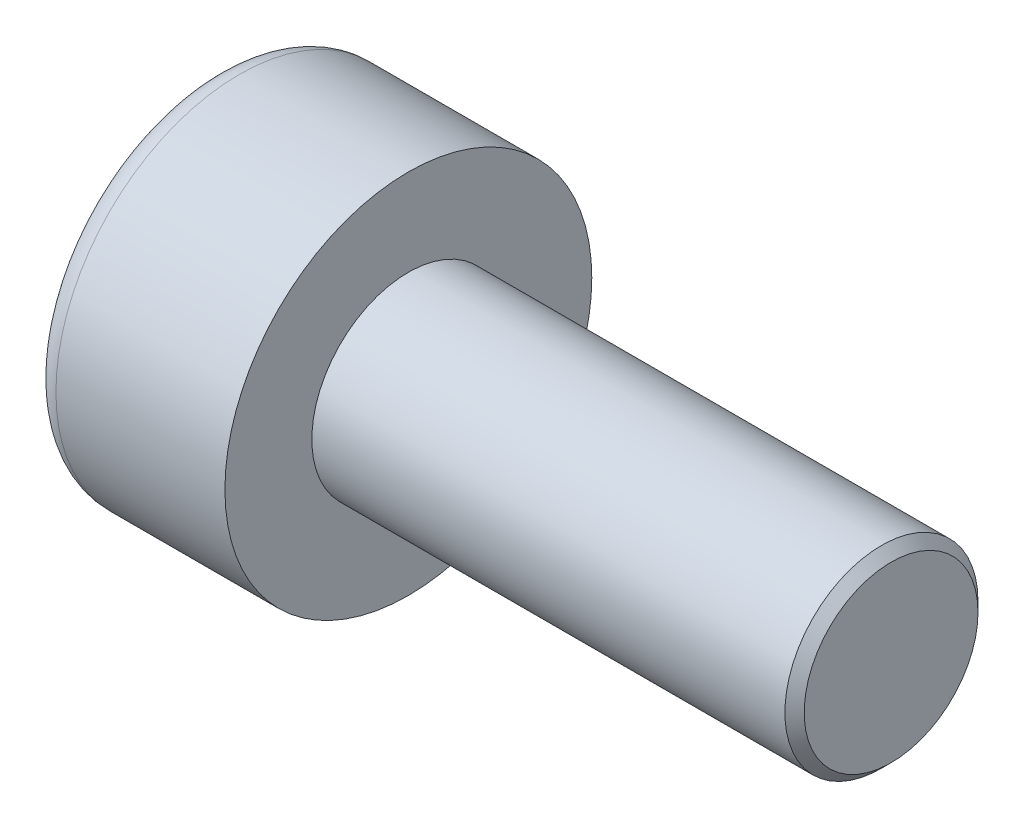
ISO-10303-21;
HEADER;
FILE_DESCRIPTION(('STEP AP214'),'2;1');
FILE_NAME('part.step','',(''),(''),'','','');
FILE_SCHEMA(('AUTOMOTIVE_DESIGN { 1 0 10303 214 1 1 1 1 }'));
ENDSEC;
DATA;
#1=APPLICATION_CONTEXT('core data for automotive mechanical design processes');
#2=APPLICATION_PROTOCOL_DEFINITION('international standard','automotive_design',2000,#1);
#3=PRODUCT_CONTEXT('',#1,'mechanical');
#4=PRODUCT('Part','Part','',(#3));
#5=PRODUCT_RELATED_PRODUCT_CATEGORY('part','',(#4));
#6=PRODUCT_DEFINITION_FORMATION('','',#4);
#7=PRODUCT_DEFINITION_CONTEXT('part definition',#1,'design');
#8=PRODUCT_DEFINITION('design','',#6,#7);
#9=PRODUCT_DEFINITION_SHAPE('','',#8);
#10=(LENGTH_UNIT() NAMED_UNIT(*) SI_UNIT(.MILLI.,.METRE.));
#11=(NAMED_UNIT(*) PLANE_ANGLE_UNIT() SI_UNIT($,.RADIAN.));
#12=(NAMED_UNIT(*) SI_UNIT($,.STERADIAN.) SOLID_ANGLE_UNIT());
#13=UNCERTAINTY_MEASURE_WITH_UNIT(LENGTH_MEASURE(1.E-05),#10,'distance_accuracy_value','');
#14=(GEOMETRIC_REPRESENTATION_CONTEXT(3) GLOBAL_UNCERTAINTY_ASSIGNED_CONTEXT((#13)) GLOBAL_UNIT_ASSIGNED_CONTEXT((#10,
#11,#12)) REPRESENTATION_CONTEXT('',''));
#15=CARTESIAN_POINT('',(0.,0.,0.));
#16=DIRECTION('',(0.,0.,1.));
#17=DIRECTION('',(1.,0.,0.));
#18=AXIS2_PLACEMENT_3D('',#15,#16,#17);
#19=CARTESIAN_POINT('',(1.,-1.5,0.));
#20=DIRECTION('',(-1.,0.,0.));
#21=DIRECTION('',(0.,0.,1.));
#22=AXIS2_PLACEMENT_3D('',#19,#20,#21);
#23=PLANE('',#22);
#24=DIRECTION('',(0.,-0.866025403784438,-0.500000000000001));
#25=VECTOR('',#24,1.);
#26=CARTESIAN_POINT('',(1.,0.,0.866025403784438));
#27=LINE('',#26,#25);
#28=CARTESIAN_POINT('',(1.,-0.375,0.649519052838328));
#29=VERTEX_POINT('',#28);
#30=CARTESIAN_POINT('',(1.,-0.749999999999999,0.433012701892218));
#31=VERTEX_POINT('',#30);
#32=EDGE_CURVE('E161',#29,#31,#27,.T.);
#33=ORIENTED_EDGE('',*,*,#32,.F.);
#34=CARTESIAN_POINT('',(1.,0.,0.));
#35=DIRECTION('',(-1.,0.,0.));
#36=DIRECTION('',(0.,0.,1.));
#37=AXIS2_PLACEMENT_3D('',#34,#35,#36);
#38=CIRCLE('',#37,0.749999999999999);
#39=CARTESIAN_POINT('',(1.,-0.749999999999999,0.));
#40=VERTEX_POINT('',#39);
#41=EDGE_CURVE('E56',#29,#40,#38,.F.);
#42=ORIENTED_EDGE('',*,*,#41,.T.);
#43=DIRECTION('',(0.,0.,-1.));
#44=VECTOR('',#43,1.);
#45=CARTESIAN_POINT('',(1.,-0.749999999999999,0.433012701892218));
#46=LINE('',#45,#44);
#47=EDGE_CURVE('E166',#31,#40,#46,.T.);
#48=ORIENTED_EDGE('',*,*,#47,.F.);
#49=EDGE_LOOP('',(#33,#42,#48));
#50=FACE_BOUND('',#49,.T.);
#51=ADVANCED_FACE('F41',(#50),#23,.T.);
#52=CARTESIAN_POINT('',(1.,-0.749999999999999,-0.433012701892221));
#53=VERTEX_POINT('',#52);
#54=EDGE_CURVE('E165',#40,#53,#46,.T.);
#55=ORIENTED_EDGE('',*,*,#54,.F.);
#56=CARTESIAN_POINT('',(1.,-0.375,-0.649519052838329));
#57=VERTEX_POINT('',#56);
#58=EDGE_CURVE('E141',#40,#57,#38,.F.);
#59=ORIENTED_EDGE('',*,*,#58,.T.);
#60=DIRECTION('',(0.,0.866025403784439,-0.5));
#61=VECTOR('',#60,1.);
#62=CARTESIAN_POINT('',(1.,-0.749999999999999,-0.433012701892221));
#63=LINE('',#62,#61);
#64=EDGE_CURVE('E149',#53,#57,#63,.T.);
#65=ORIENTED_EDGE('',*,*,#64,.F.);
#66=EDGE_LOOP('',(#55,#59,#65));
#67=FACE_BOUND('',#66,.T.);
#68=ADVANCED_FACE('F222',(#67),#23,.T.);
#69=CARTESIAN_POINT('',(1.,0.,-0.86602540378444));
#70=VERTEX_POINT('',#69);
#71=EDGE_CURVE('E139',#57,#70,#63,.T.);
#72=ORIENTED_EDGE('',*,*,#71,.F.);
#73=CARTESIAN_POINT('',(1.,0.375,-0.649519052838328));
#74=VERTEX_POINT('',#73);
#75=EDGE_CURVE('E123',#57,#74,#38,.F.);
#76=ORIENTED_EDGE('',*,*,#75,.T.);
#77=DIRECTION('',(0.,0.866025403784438,0.5));
#78=VECTOR('',#77,1.);
#79=CARTESIAN_POINT('',(1.,0.,-0.86602540378444));
#80=LINE('',#79,#78);
#81=EDGE_CURVE('E137',#70,#74,#80,.T.);
#82=ORIENTED_EDGE('',*,*,#81,.F.);
#83=EDGE_LOOP('',(#72,#76,#82));
#84=FACE_BOUND('',#83,.T.);
#85=ADVANCED_FACE('F135',(#84),#23,.T.);
#86=CARTESIAN_POINT('',(1.,0.75,-0.43301270189222));
#87=VERTEX_POINT('',#86);
#88=EDGE_CURVE('E143',#74,#87,#80,.T.);
#89=ORIENTED_EDGE('',*,*,#88,.F.);
#90=CARTESIAN_POINT('',(1.,0.,0.));
#91=DIRECTION('',(1.,0.,0.));
#92=DIRECTION('',(0.,0.,-1.));
#93=AXIS2_PLACEMENT_3D('',#90,#91,#92);
#94=CIRCLE('',#93,0.749999999999999);
#95=CARTESIAN_POINT('',(1.,0.749999999999999,0.));
#96=VERTEX_POINT('',#95);
#97=EDGE_CURVE('E121',#74,#96,#94,.T.);
#98=ORIENTED_EDGE('',*,*,#97,.T.);
#99=DIRECTION('',(0.,0.,1.));
#100=VECTOR('',#99,1.);
#101=CARTESIAN_POINT('',(1.,0.75,-0.43301270189222));
#102=LINE('',#101,#100);
#103=EDGE_CURVE('E146',#87,#96,#102,.T.);
#104=ORIENTED_EDGE('',*,*,#103,.F.);
#105=EDGE_LOOP('',(#89,#98,#104));
#106=FACE_BOUND('',#105,.T.);
#107=ADVANCED_FACE('F144',(#106),#23,.T.);
#108=CARTESIAN_POINT('',(1.,0.75,0.433012701892218));
#109=VERTEX_POINT('',#108);
#110=EDGE_CURVE('E153',#96,#109,#102,.T.);
#111=ORIENTED_EDGE('',*,*,#110,.F.);
#112=CARTESIAN_POINT('',(1.,0.375,0.649519052838328));
#113=VERTEX_POINT('',#112);
#114=EDGE_CURVE('E126',#96,#113,#38,.F.);
#115=ORIENTED_EDGE('',*,*,#114,.T.);
#116=DIRECTION('',(0.,-0.866025403784438,0.5));
#117=VECTOR('',#116,1.);
#118=CARTESIAN_POINT('',(1.,0.75,0.433012701892218));
#119=LINE('',#118,#117);
#120=EDGE_CURVE('E158',#109,#113,#119,.T.);
#121=ORIENTED_EDGE('',*,*,#120,.F.);
#122=EDGE_LOOP('',(#111,#115,#121));
#123=FACE_BOUND('',#122,.T.);
#124=ADVANCED_FACE('F234',(#123),#23,.T.);
#125=CARTESIAN_POINT('',(1.,0.,0.866025403784438));
#126=VERTEX_POINT('',#125);
#127=EDGE_CURVE('E157',#113,#126,#119,.T.);
#128=ORIENTED_EDGE('',*,*,#127,.F.);
#129=EDGE_CURVE('E202',#113,#29,#38,.F.);
#130=ORIENTED_EDGE('',*,*,#129,.T.);
#131=EDGE_CURVE('E162',#126,#29,#27,.T.);
#132=ORIENTED_EDGE('',*,*,#131,.F.);
#133=EDGE_LOOP('',(#128,#130,#132));
#134=FACE_BOUND('',#133,.T.);
#135=ADVANCED_FACE('F225',(#134),#23,.T.);
#136=CARTESIAN_POINT('',(0.,0.,0.));
#137=DIRECTION('',(1.,0.,0.));
#138=DIRECTION('',(0.,0.,-1.));
#139=AXIS2_PLACEMENT_3D('',#136,#137,#138);
#140=PLANE('',#139);
#141=CARTESIAN_POINT('',(0.,0.,0.));
#142=DIRECTION('',(1.,0.,0.));
#143=DIRECTION('',(0.,0.,-1.));
#144=AXIS2_PLACEMENT_3D('',#141,#142,#143);
#145=CIRCLE('',#144,1.65);
#146=CARTESIAN_POINT('',(0.,0.,-1.65));
#147=VERTEX_POINT('',#146);
#148=EDGE_CURVE('E207',#147,#147,#145,.F.);
#149=ORIENTED_EDGE('',*,*,#148,.T.);
#150=EDGE_LOOP('',(#149));
#151=FACE_BOUND('',#150,.T.);
#152=DIRECTION('',(0.,0.866025403784439,-0.5));
#153=VECTOR('',#152,1.);
#154=CARTESIAN_POINT('',(0.,-0.749999999999999,-0.433012701892221));
#155=LINE('',#154,#153);
#156=CARTESIAN_POINT('',(0.,-0.749999999999999,-0.433012701892221));
#157=VERTEX_POINT('',#156);
#158=CARTESIAN_POINT('',(0.,0.,-0.86602540378444));
#159=VERTEX_POINT('',#158);
#160=EDGE_CURVE('E64',#157,#159,#155,.T.);
#161=ORIENTED_EDGE('',*,*,#160,.T.);
#162=DIRECTION('',(0.,0.866025403784438,0.5));
#163=VECTOR('',#162,1.);
#164=CARTESIAN_POINT('',(0.,0.,-0.86602540378444));
#165=LINE('',#164,#163);
#166=CARTESIAN_POINT('',(0.,0.75,-0.43301270189222));
#167=VERTEX_POINT('',#166);
#168=EDGE_CURVE('E171',#159,#167,#165,.T.);
#169=ORIENTED_EDGE('',*,*,#168,.T.);
#170=DIRECTION('',(0.,0.,1.));
#171=VECTOR('',#170,1.);
#172=CARTESIAN_POINT('',(0.,0.75,-0.43301270189222));
#173=LINE('',#172,#171);
#174=CARTESIAN_POINT('',(0.,0.75,0.433012701892218));
#175=VERTEX_POINT('',#174);
#176=EDGE_CURVE('E174',#167,#175,#173,.T.);
#177=ORIENTED_EDGE('',*,*,#176,.T.);
#178=DIRECTION('',(0.,-0.866025403784438,0.5));
#179=VECTOR('',#178,1.);
#180=CARTESIAN_POINT('',(0.,0.75,0.433012701892218));
#181=LINE('',#180,#179);
#182=CARTESIAN_POINT('',(0.,0.,0.866025403784438));
#183=VERTEX_POINT('',#182);
#184=EDGE_CURVE('E177',#175,#183,#181,.T.);
#185=ORIENTED_EDGE('',*,*,#184,.T.);
#186=DIRECTION('',(0.,-0.866025403784438,-0.500000000000001));
#187=VECTOR('',#186,1.);
#188=CARTESIAN_POINT('',(0.,0.,0.866025403784438));
#189=LINE('',#188,#187);
#190=CARTESIAN_POINT('',(0.,-0.749999999999999,0.433012701892218));
#191=VERTEX_POINT('',#190);
#192=EDGE_CURVE('E180',#183,#191,#189,.T.);
#193=ORIENTED_EDGE('',*,*,#192,.T.);
#194=DIRECTION('',(0.,0.,-1.));
#195=VECTOR('',#194,1.);
#196=CARTESIAN_POINT('',(0.,-0.749999999999999,0.433012701892218));
#197=LINE('',#196,#195);
#198=EDGE_CURVE('E183',#191,#157,#197,.T.);
#199=ORIENTED_EDGE('',*,*,#198,.T.);
#200=EDGE_LOOP('',(#161,#169,#177,#185,#193,#199));
#201=FACE_BOUND('',#200,.T.);
#202=ADVANCED_FACE('F233',(#151,#201),#140,.F.);
#203=CARTESIAN_POINT('',(2.,0.,0.));
#204=DIRECTION('',(1.,0.,0.));
#205=DIRECTION('',(0.,0.,-1.));
#206=AXIS2_PLACEMENT_3D('',#203,#204,#205);
#207=PLANE('',#206);
#208=CARTESIAN_POINT('',(2.,0.,0.));
#209=DIRECTION('',(1.,0.,0.));
#210=DIRECTION('',(0.,0.,-1.));
#211=AXIS2_PLACEMENT_3D('',#208,#209,#210);
#212=CIRCLE('',#211,1.9);
#213=CARTESIAN_POINT('',(2.,0.,-1.9));
#214=VERTEX_POINT('',#213);
#215=EDGE_CURVE('E199',#214,#214,#212,.T.);
#216=ORIENTED_EDGE('',*,*,#215,.T.);
#217=EDGE_LOOP('',(#216));
#218=FACE_BOUND('',#217,.T.);
#219=CARTESIAN_POINT('',(2.,0.,0.));
#220=DIRECTION('',(1.,0.,0.));
#221=DIRECTION('',(0.,0.,-1.));
#222=AXIS2_PLACEMENT_3D('',#219,#220,#221);
#223=CIRCLE('',#222,1.);
#224=CARTESIAN_POINT('',(2.,0.,-1.));
#225=VERTEX_POINT('',#224);
#226=EDGE_CURVE('E196',#225,#225,#223,.T.);
#227=ORIENTED_EDGE('',*,*,#226,.F.);
#228=EDGE_LOOP('',(#227));
#229=FACE_BOUND('',#228,.T.);
#230=ADVANCED_FACE('F240',(#218,#229),#207,.T.);
#231=CARTESIAN_POINT('',(2.,0.,0.));
#232=DIRECTION('',(-1.,0.,0.));
#233=DIRECTION('',(0.,0.,1.));
#234=AXIS2_PLACEMENT_3D('',#231,#232,#233);
#235=CYLINDRICAL_SURFACE('',#234,1.9);
#236=CARTESIAN_POINT('',(0.25,0.,0.));
#237=DIRECTION('',(1.,0.,0.));
#238=DIRECTION('',(0.,0.,-1.));
#239=AXIS2_PLACEMENT_3D('',#236,#237,#238);
#240=CIRCLE('',#239,1.9);
#241=CARTESIAN_POINT('',(0.25,0.,-1.9));
#242=VERTEX_POINT('',#241);
#243=EDGE_CURVE('E204',#242,#242,#240,.T.);
#244=ORIENTED_EDGE('',*,*,#243,.T.);
#245=EDGE_LOOP('',(#244));
#246=FACE_BOUND('',#245,.T.);
#247=ORIENTED_EDGE('',*,*,#215,.F.);
#248=EDGE_LOOP('',(#247));
#249=FACE_BOUND('',#248,.T.);
#250=ADVANCED_FACE('F285',(#246,#249),#235,.T.);
#251=CARTESIAN_POINT('',(7.,0.,0.));
#252=DIRECTION('',(-1.,0.,0.));
#253=DIRECTION('',(0.,0.,1.));
#254=AXIS2_PLACEMENT_3D('',#251,#252,#253);
#255=CYLINDRICAL_SURFACE('',#254,1.);
#256=CARTESIAN_POINT('',(6.9,0.,0.));
#257=DIRECTION('',(1.,0.,0.));
#258=DIRECTION('',(0.,0.,-1.));
#259=AXIS2_PLACEMENT_3D('',#256,#257,#258);
#260=CIRCLE('',#259,1.);
#261=CARTESIAN_POINT('',(6.9,0.,-1.));
#262=VERTEX_POINT('',#261);
#263=EDGE_CURVE('E11',#262,#262,#260,.F.);
#264=ORIENTED_EDGE('',*,*,#263,.T.);
#265=EDGE_LOOP('',(#264));
#266=FACE_BOUND('',#265,.T.);
#267=ORIENTED_EDGE('',*,*,#226,.T.);
#268=EDGE_LOOP('',(#267));
#269=FACE_BOUND('',#268,.T.);
#270=ADVANCED_FACE('F282',(#266,#269),#255,.T.);
#271=CARTESIAN_POINT('',(7.,0.,0.));
#272=DIRECTION('',(1.,0.,0.));
#273=DIRECTION('',(0.,0.,-1.));
#274=AXIS2_PLACEMENT_3D('',#271,#272,#273);
#275=PLANE('',#274);
#276=CARTESIAN_POINT('',(7.,0.,0.));
#277=DIRECTION('',(1.,0.,0.));
#278=DIRECTION('',(0.,0.,-1.));
#279=AXIS2_PLACEMENT_3D('',#276,#277,#278);
#280=CIRCLE('',#279,0.900000000000001);
#281=CARTESIAN_POINT('',(7.,0.,-0.900000000000001));
#282=VERTEX_POINT('',#281);
#283=EDGE_CURVE('E49',#282,#282,#280,.T.);
#284=ORIENTED_EDGE('',*,*,#283,.T.);
#285=EDGE_LOOP('',(#284));
#286=FACE_BOUND('',#285,.T.);
#287=ADVANCED_FACE('F212',(#286),#275,.T.);
#288=CARTESIAN_POINT('',(1.,-0.749999999999999,-0.433012701892221));
#289=DIRECTION('',(0.,0.5,0.866025403784439));
#290=DIRECTION('',(0.,-0.866025403784439,0.5));
#291=AXIS2_PLACEMENT_3D('',#288,#289,#290);
#292=PLANE('',#291);
#293=ORIENTED_EDGE('',*,*,#160,.F.);
#294=DIRECTION('',(-1.,0.,0.));
#295=VECTOR('',#294,1.);
#296=CARTESIAN_POINT('',(1.,-0.749999999999999,-0.433012701892221));
#297=LINE('',#296,#295);
#298=EDGE_CURVE('E169',#53,#157,#297,.T.);
#299=ORIENTED_EDGE('',*,*,#298,.F.);
#300=ORIENTED_EDGE('',*,*,#64,.T.);
#301=ORIENTED_EDGE('',*,*,#71,.T.);
#302=DIRECTION('',(-1.,0.,0.));
#303=VECTOR('',#302,1.);
#304=CARTESIAN_POINT('',(1.,0.,-0.86602540378444));
#305=LINE('',#304,#303);
#306=EDGE_CURVE('E152',#70,#159,#305,.T.);
#307=ORIENTED_EDGE('',*,*,#306,.T.);
#308=EDGE_LOOP('',(#293,#299,#300,#301,#307));
#309=FACE_BOUND('',#308,.T.);
#310=ADVANCED_FACE('F256',(#309),#292,.T.);
#311=CARTESIAN_POINT('',(1.,0.,-0.86602540378444));
#312=DIRECTION('',(0.,-0.5,0.866025403784439));
#313=DIRECTION('',(0.,-0.866025403784438,-0.5));
#314=AXIS2_PLACEMENT_3D('',#311,#312,#313);
#315=PLANE('',#314);
#316=ORIENTED_EDGE('',*,*,#168,.F.);
#317=ORIENTED_EDGE('',*,*,#306,.F.);
#318=ORIENTED_EDGE('',*,*,#81,.T.);
#319=ORIENTED_EDGE('',*,*,#88,.T.);
#320=DIRECTION('',(-1.,0.,0.));
#321=VECTOR('',#320,1.);
#322=CARTESIAN_POINT('',(1.,0.75,-0.43301270189222));
#323=LINE('',#322,#321);
#324=EDGE_CURVE('E193',#87,#167,#323,.T.);
#325=ORIENTED_EDGE('',*,*,#324,.T.);
#326=EDGE_LOOP('',(#316,#317,#318,#319,#325));
#327=FACE_BOUND('',#326,.T.);
#328=ADVANCED_FACE('F151',(#327),#315,.T.);
#329=CARTESIAN_POINT('',(1.,0.75,-0.43301270189222));
#330=DIRECTION('',(0.,-1.,0.));
#331=DIRECTION('',(0.,0.,-1.));
#332=AXIS2_PLACEMENT_3D('',#329,#330,#331);
#333=PLANE('',#332);
#334=ORIENTED_EDGE('',*,*,#176,.F.);
#335=ORIENTED_EDGE('',*,*,#324,.F.);
#336=ORIENTED_EDGE('',*,*,#103,.T.);
#337=ORIENTED_EDGE('',*,*,#110,.T.);
#338=DIRECTION('',(-1.,0.,0.));
#339=VECTOR('',#338,1.);
#340=CARTESIAN_POINT('',(1.,0.75,0.433012701892218));
#341=LINE('',#340,#339);
#342=EDGE_CURVE('E191',#109,#175,#341,.T.);
#343=ORIENTED_EDGE('',*,*,#342,.T.);
#344=EDGE_LOOP('',(#334,#335,#336,#337,#343));
#345=FACE_BOUND('',#344,.T.);
#346=ADVANCED_FACE('F254',(#345),#333,.T.);
#347=CARTESIAN_POINT('',(1.,0.75,0.433012701892218));
#348=DIRECTION('',(0.,-0.5,-0.866025403784438));
#349=DIRECTION('',(0.,0.866025403784439,-0.5));
#350=AXIS2_PLACEMENT_3D('',#347,#348,#349);
#351=PLANE('',#350);
#352=ORIENTED_EDGE('',*,*,#184,.F.);
#353=ORIENTED_EDGE('',*,*,#342,.F.);
#354=ORIENTED_EDGE('',*,*,#120,.T.);
#355=ORIENTED_EDGE('',*,*,#127,.T.);
#356=DIRECTION('',(-1.,0.,0.));
#357=VECTOR('',#356,1.);
#358=CARTESIAN_POINT('',(1.,0.,0.866025403784438));
#359=LINE('',#358,#357);
#360=EDGE_CURVE('E189',#126,#183,#359,.T.);
#361=ORIENTED_EDGE('',*,*,#360,.T.);
#362=EDGE_LOOP('',(#352,#353,#354,#355,#361));
#363=FACE_BOUND('',#362,.T.);
#364=ADVANCED_FACE('F251',(#363),#351,.T.);
#365=CARTESIAN_POINT('',(1.,0.,0.866025403784438));
#366=DIRECTION('',(0.,0.500000000000001,-0.866025403784438));
#367=DIRECTION('',(0.,0.866025403784438,0.500000000000001));
#368=AXIS2_PLACEMENT_3D('',#365,#366,#367);
#369=PLANE('',#368);
#370=ORIENTED_EDGE('',*,*,#192,.F.);
#371=ORIENTED_EDGE('',*,*,#360,.F.);
#372=ORIENTED_EDGE('',*,*,#131,.T.);
#373=ORIENTED_EDGE('',*,*,#32,.T.);
#374=DIRECTION('',(-1.,0.,0.));
#375=VECTOR('',#374,1.);
#376=CARTESIAN_POINT('',(1.,-0.749999999999999,0.433012701892218));
#377=LINE('',#376,#375);
#378=EDGE_CURVE('E187',#31,#191,#377,.T.);
#379=ORIENTED_EDGE('',*,*,#378,.T.);
#380=EDGE_LOOP('',(#370,#371,#372,#373,#379));
#381=FACE_BOUND('',#380,.T.);
#382=ADVANCED_FACE('F265',(#381),#369,.T.);
#383=CARTESIAN_POINT('',(1.,-0.749999999999999,0.433012701892218));
#384=DIRECTION('',(0.,1.,0.));
#385=DIRECTION('',(0.,0.,1.));
#386=AXIS2_PLACEMENT_3D('',#383,#384,#385);
#387=PLANE('',#386);
#388=ORIENTED_EDGE('',*,*,#198,.F.);
#389=ORIENTED_EDGE('',*,*,#378,.F.);
#390=ORIENTED_EDGE('',*,*,#47,.T.);
#391=ORIENTED_EDGE('',*,*,#54,.T.);
#392=ORIENTED_EDGE('',*,*,#298,.T.);
#393=EDGE_LOOP('',(#388,#389,#390,#391,#392));
#394=FACE_BOUND('',#393,.T.);
#395=ADVANCED_FACE('F118',(#394),#387,.T.);
#396=CARTESIAN_POINT('',(1.,0.,0.));
#397=DIRECTION('',(-1.,0.,0.));
#398=DIRECTION('',(0.,0.,1.));
#399=AXIS2_PLACEMENT_3D('',#396,#397,#398);
#400=CONICAL_SURFACE('',#399,0.749999999999999,1.04719755119659);
#401=CARTESIAN_POINT('',(1.43301270189222,0.,0.));
#402=VERTEX_POINT('',#401);
#403=VERTEX_LOOP('',#402);
#404=FACE_BOUND('',#403,.T.);
#405=ORIENTED_EDGE('',*,*,#97,.F.);
#406=ORIENTED_EDGE('',*,*,#75,.F.);
#407=ORIENTED_EDGE('',*,*,#58,.F.);
#408=ORIENTED_EDGE('',*,*,#41,.F.);
#409=ORIENTED_EDGE('',*,*,#129,.F.);
#410=ORIENTED_EDGE('',*,*,#114,.F.);
#411=EDGE_LOOP('',(#405,#406,#407,#408,#409,#410));
#412=FACE_BOUND('',#411,.T.);
#413=ADVANCED_FACE('F115',(#404,#412),#400,.F.);
#414=CARTESIAN_POINT('',(0.25,0.,0.));
#415=DIRECTION('',(1.,0.,0.));
#416=DIRECTION('',(0.,0.,-1.));
#417=AXIS2_PLACEMENT_3D('',#414,#415,#416);
#418=TOROIDAL_SURFACE('',#417,1.65,0.25);
#419=ORIENTED_EDGE('',*,*,#148,.F.);
#420=EDGE_LOOP('',(#419));
#421=FACE_BOUND('',#420,.T.);
#422=ORIENTED_EDGE('',*,*,#243,.F.);
#423=EDGE_LOOP('',(#422));
#424=FACE_BOUND('',#423,.T.);
#425=ADVANCED_FACE('F117',(#421,#424),#418,.T.);
#426=CARTESIAN_POINT('',(7.,0.,0.));
#427=DIRECTION('',(-1.,0.,0.));
#428=DIRECTION('',(0.,0.,1.));
#429=AXIS2_PLACEMENT_3D('',#426,#427,#428);
#430=CONICAL_SURFACE('',#429,0.900000000000001,0.78539816339744);
#431=ORIENTED_EDGE('',*,*,#263,.F.);
#432=EDGE_LOOP('',(#431));
#433=FACE_BOUND('',#432,.T.);
#434=ORIENTED_EDGE('',*,*,#283,.F.);
#435=EDGE_LOOP('',(#434));
#436=FACE_BOUND('',#435,.T.);
#437=ADVANCED_FACE('F43',(#433,#436),#430,.T.);
#438=CLOSED_SHELL('',(#51,#68,#85,#107,#124,#135,#202,#230,#250,#270,#287,#310,#328,#346,#364,
#382,#395,#413,#425,#437));
#439=MANIFOLD_SOLID_BREP('B2',#438);
#440=ADVANCED_BREP_SHAPE_REPRESENTATION('',(#18,#439),#14);
#441=SHAPE_DEFINITION_REPRESENTATION(#9,#440);
ENDSEC;
END-ISO-10303-21;
